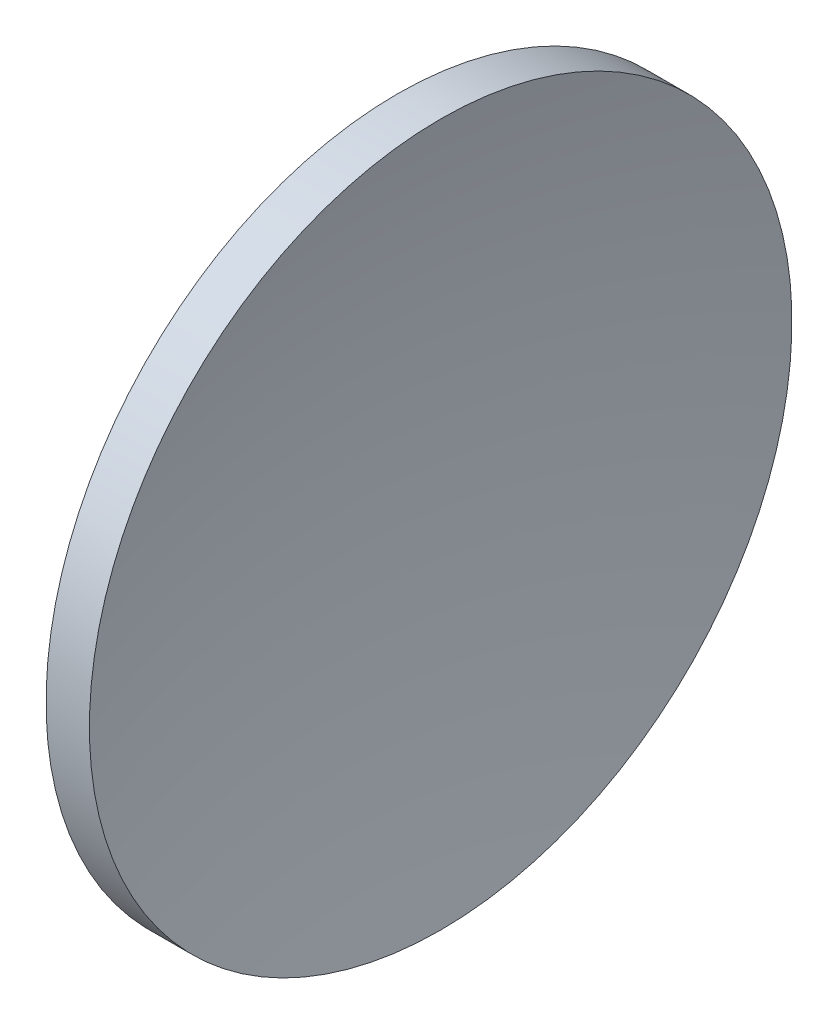
ISO-10303-21;
HEADER;
FILE_DESCRIPTION(('STEP AP214'),'2;1');
FILE_NAME('part.step','',(''),(''),'','','');
FILE_SCHEMA(('AUTOMOTIVE_DESIGN { 1 0 10303 214 1 1 1 1 }'));
ENDSEC;
DATA;
#1=APPLICATION_CONTEXT('core data for automotive mechanical design processes');
#2=APPLICATION_PROTOCOL_DEFINITION('international standard','automotive_design',2000,#1);
#3=PRODUCT_CONTEXT('',#1,'mechanical');
#4=PRODUCT('Part','Part','',(#3));
#5=PRODUCT_RELATED_PRODUCT_CATEGORY('part','',(#4));
#6=PRODUCT_DEFINITION_FORMATION('','',#4);
#7=PRODUCT_DEFINITION_CONTEXT('part definition',#1,'design');
#8=PRODUCT_DEFINITION('design','',#6,#7);
#9=PRODUCT_DEFINITION_SHAPE('','',#8);
#10=(LENGTH_UNIT() NAMED_UNIT(*) SI_UNIT(.MILLI.,.METRE.));
#11=(NAMED_UNIT(*) PLANE_ANGLE_UNIT() SI_UNIT($,.RADIAN.));
#12=(NAMED_UNIT(*) SI_UNIT($,.STERADIAN.) SOLID_ANGLE_UNIT());
#13=UNCERTAINTY_MEASURE_WITH_UNIT(LENGTH_MEASURE(1.E-05),#10,'distance_accuracy_value','');
#14=(GEOMETRIC_REPRESENTATION_CONTEXT(3) GLOBAL_UNCERTAINTY_ASSIGNED_CONTEXT((#13)) GLOBAL_UNIT_ASSIGNED_CONTEXT((#10,
#11,#12)) REPRESENTATION_CONTEXT('',''));
#15=CARTESIAN_POINT('',(0.,0.,0.));
#16=DIRECTION('',(0.,0.,1.));
#17=DIRECTION('',(1.,0.,0.));
#18=AXIS2_PLACEMENT_3D('',#15,#16,#17);
#19=CARTESIAN_POINT('',(156.455421315556,65.2168404709403,0.));
#20=DIRECTION('',(-1.,0.,0.));
#21=DIRECTION('',(0.,1.,0.));
#22=AXIS2_PLACEMENT_3D('',#19,#20,#21);
#23=SPHERICAL_SURFACE('',#22,33.6);
#24=CARTESIAN_POINT('',(128.760487212005,65.2168404709403,0.));
#25=DIRECTION('',(-1.,0.,0.));
#26=DIRECTION('',(0.,-1.,0.));
#27=AXIS2_PLACEMENT_3D('',#24,#25,#26);
#28=CIRCLE('',#27,19.025);
#29=CARTESIAN_POINT('',(128.760487212005,46.1918404709404,0.));
#30=VERTEX_POINT('',#29);
#31=EDGE_CURVE('E41',#30,#30,#28,.T.);
#32=ORIENTED_EDGE('',*,*,#31,.T.);
#33=EDGE_LOOP('',(#32));
#34=FACE_BOUND('',#33,.T.);
#35=ADVANCED_FACE('F35',(#34),#23,.T.);
#36=CARTESIAN_POINT('',(210.355421315556,65.2168404709403,0.));
#37=DIRECTION('',(-1.,0.,0.));
#38=DIRECTION('',(0.,1.,0.));
#39=AXIS2_PLACEMENT_3D('',#36,#37,#38);
#40=SPHERICAL_SURFACE('',#39,81.5);
#41=CARTESIAN_POINT('',(131.107081427581,65.2168404709403,0.));
#42=DIRECTION('',(-1.,0.,0.));
#43=DIRECTION('',(0.,-1.,0.));
#44=AXIS2_PLACEMENT_3D('',#41,#42,#43);
#45=CIRCLE('',#44,19.025);
#46=CARTESIAN_POINT('',(131.107081427581,46.1918404709404,0.));
#47=VERTEX_POINT('',#46);
#48=EDGE_CURVE('E10',#47,#47,#45,.T.);
#49=ORIENTED_EDGE('',*,*,#48,.F.);
#50=EDGE_LOOP('',(#49));
#51=FACE_BOUND('',#50,.T.);
#52=ADVANCED_FACE('F50',(#51),#40,.F.);
#53=CARTESIAN_POINT('',(115.944491297963,65.2168404709403,0.));
#54=DIRECTION('',(-1.,0.,0.));
#55=DIRECTION('',(0.,-1.,0.));
#56=AXIS2_PLACEMENT_3D('',#53,#54,#55);
#57=CYLINDRICAL_SURFACE('',#56,19.025);
#58=ORIENTED_EDGE('',*,*,#31,.F.);
#59=EDGE_LOOP('',(#58));
#60=FACE_BOUND('',#59,.T.);
#61=ORIENTED_EDGE('',*,*,#48,.T.);
#62=EDGE_LOOP('',(#61));
#63=FACE_BOUND('',#62,.T.);
#64=ADVANCED_FACE('F48',(#60,#63),#57,.T.);
#65=CLOSED_SHELL('',(#35,#52,#64));
#66=MANIFOLD_SOLID_BREP('B2',#65);
#67=ADVANCED_BREP_SHAPE_REPRESENTATION('',(#18,#66),#14);
#68=SHAPE_DEFINITION_REPRESENTATION(#9,#67);
ENDSEC;
END-ISO-10303-21;
